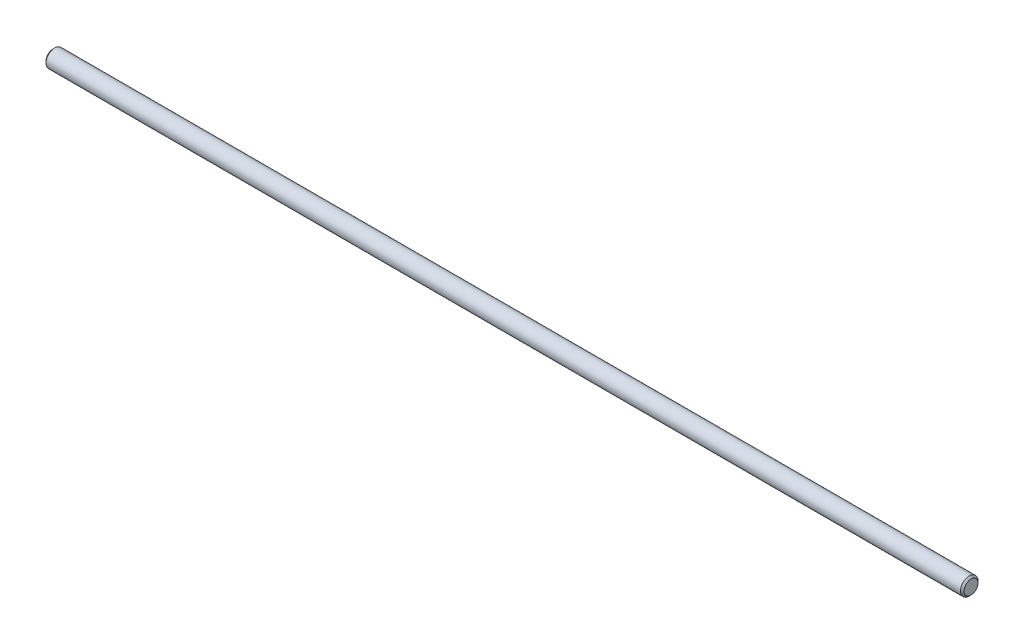
ISO-10303-21;
HEADER;
FILE_DESCRIPTION(('STEP AP214'),'2;1');
FILE_NAME('part.step','',(''),(''),'','','');
FILE_SCHEMA(('AUTOMOTIVE_DESIGN { 1 0 10303 214 1 1 1 1 }'));
ENDSEC;
DATA;
#1=APPLICATION_CONTEXT('core data for automotive mechanical design processes');
#2=APPLICATION_PROTOCOL_DEFINITION('international standard','automotive_design',2000,#1);
#3=PRODUCT_CONTEXT('',#1,'mechanical');
#4=PRODUCT('Part','Part','',(#3));
#5=PRODUCT_RELATED_PRODUCT_CATEGORY('part','',(#4));
#6=PRODUCT_DEFINITION_FORMATION('','',#4);
#7=PRODUCT_DEFINITION_CONTEXT('part definition',#1,'design');
#8=PRODUCT_DEFINITION('design','',#6,#7);
#9=PRODUCT_DEFINITION_SHAPE('','',#8);
#10=(LENGTH_UNIT() NAMED_UNIT(*) SI_UNIT(.MILLI.,.METRE.));
#11=(NAMED_UNIT(*) PLANE_ANGLE_UNIT() SI_UNIT($,.RADIAN.));
#12=(NAMED_UNIT(*) SI_UNIT($,.STERADIAN.) SOLID_ANGLE_UNIT());
#13=UNCERTAINTY_MEASURE_WITH_UNIT(LENGTH_MEASURE(1.E-05),#10,'distance_accuracy_value','');
#14=(GEOMETRIC_REPRESENTATION_CONTEXT(3) GLOBAL_UNCERTAINTY_ASSIGNED_CONTEXT((#13)) GLOBAL_UNIT_ASSIGNED_CONTEXT((#10,
#11,#12)) REPRESENTATION_CONTEXT('',''));
#15=CARTESIAN_POINT('',(0.,0.,0.));
#16=DIRECTION('',(0.,0.,1.));
#17=DIRECTION('',(1.,0.,0.));
#18=AXIS2_PLACEMENT_3D('',#15,#16,#17);
#19=CARTESIAN_POINT('',(210.,0.,0.));
#20=DIRECTION('',(-1.,0.,0.));
#21=DIRECTION('',(0.,0.,1.));
#22=AXIS2_PLACEMENT_3D('',#19,#20,#21);
#23=CYLINDRICAL_SURFACE('',#22,4.);
#24=CARTESIAN_POINT('',(-209.2,0.,0.));
#25=DIRECTION('',(1.,0.,0.));
#26=DIRECTION('',(0.,0.,-1.));
#27=AXIS2_PLACEMENT_3D('',#24,#25,#26);
#28=CIRCLE('',#27,4.);
#29=CARTESIAN_POINT('',(-209.2,0.,-4.));
#30=VERTEX_POINT('',#29);
#31=EDGE_CURVE('E46',#30,#30,#28,.T.);
#32=ORIENTED_EDGE('',*,*,#31,.T.);
#33=EDGE_LOOP('',(#32));
#34=FACE_BOUND('',#33,.T.);
#35=CARTESIAN_POINT('',(209.2,0.,0.));
#36=DIRECTION('',(1.,0.,0.));
#37=DIRECTION('',(0.,0.,-1.));
#38=AXIS2_PLACEMENT_3D('',#35,#36,#37);
#39=CIRCLE('',#38,4.);
#40=CARTESIAN_POINT('',(209.2,0.,-4.));
#41=VERTEX_POINT('',#40);
#42=EDGE_CURVE('E50',#41,#41,#39,.F.);
#43=ORIENTED_EDGE('',*,*,#42,.T.);
#44=EDGE_LOOP('',(#43));
#45=FACE_BOUND('',#44,.T.);
#46=ADVANCED_FACE('F35',(#34,#45),#23,.T.);
#47=CARTESIAN_POINT('',(210.,0.,0.));
#48=DIRECTION('',(1.,0.,0.));
#49=DIRECTION('',(0.,0.,-1.));
#50=AXIS2_PLACEMENT_3D('',#47,#48,#49);
#51=PLANE('',#50);
#52=CARTESIAN_POINT('',(210.,0.,0.));
#53=DIRECTION('',(1.,0.,0.));
#54=DIRECTION('',(0.,0.,-1.));
#55=AXIS2_PLACEMENT_3D('',#52,#53,#54);
#56=CIRCLE('',#55,3.20000000000009);
#57=CARTESIAN_POINT('',(210.,0.,-3.20000000000009));
#58=VERTEX_POINT('',#57);
#59=EDGE_CURVE('E10',#58,#58,#56,.T.);
#60=ORIENTED_EDGE('',*,*,#59,.T.);
#61=EDGE_LOOP('',(#60));
#62=FACE_BOUND('',#61,.T.);
#63=ADVANCED_FACE('F66',(#62),#51,.T.);
#64=CARTESIAN_POINT('',(-210.,0.,0.));
#65=DIRECTION('',(1.,0.,0.));
#66=DIRECTION('',(0.,0.,-1.));
#67=AXIS2_PLACEMENT_3D('',#64,#65,#66);
#68=PLANE('',#67);
#69=CARTESIAN_POINT('',(-210.,0.,0.));
#70=DIRECTION('',(1.,0.,0.));
#71=DIRECTION('',(0.,0.,-1.));
#72=AXIS2_PLACEMENT_3D('',#69,#70,#71);
#73=CIRCLE('',#72,3.19999999999998);
#74=CARTESIAN_POINT('',(-210.,0.,-3.19999999999998));
#75=VERTEX_POINT('',#74);
#76=EDGE_CURVE('E42',#75,#75,#73,.F.);
#77=ORIENTED_EDGE('',*,*,#76,.T.);
#78=EDGE_LOOP('',(#77));
#79=FACE_BOUND('',#78,.T.);
#80=ADVANCED_FACE('F63',(#79),#68,.F.);
#81=CARTESIAN_POINT('',(-209.2,0.,0.));
#82=DIRECTION('',(1.,0.,0.));
#83=DIRECTION('',(0.,0.,-1.));
#84=AXIS2_PLACEMENT_3D('',#81,#82,#83);
#85=CONICAL_SURFACE('',#84,4.,0.785398163397446);
#86=ORIENTED_EDGE('',*,*,#76,.F.);
#87=EDGE_LOOP('',(#86));
#88=FACE_BOUND('',#87,.T.);
#89=ORIENTED_EDGE('',*,*,#31,.F.);
#90=EDGE_LOOP('',(#89));
#91=FACE_BOUND('',#90,.T.);
#92=ADVANCED_FACE('F59',(#88,#91),#85,.T.);
#93=CARTESIAN_POINT('',(210.,0.,0.));
#94=DIRECTION('',(-1.,0.,0.));
#95=DIRECTION('',(0.,0.,1.));
#96=AXIS2_PLACEMENT_3D('',#93,#94,#95);
#97=CONICAL_SURFACE('',#96,3.20000000000009,0.785398163397446);
#98=ORIENTED_EDGE('',*,*,#42,.F.);
#99=EDGE_LOOP('',(#98));
#100=FACE_BOUND('',#99,.T.);
#101=ORIENTED_EDGE('',*,*,#59,.F.);
#102=EDGE_LOOP('',(#101));
#103=FACE_BOUND('',#102,.T.);
#104=ADVANCED_FACE('F37',(#100,#103),#97,.T.);
#105=CLOSED_SHELL('',(#46,#63,#80,#92,#104));
#106=MANIFOLD_SOLID_BREP('B2',#105);
#107=ADVANCED_BREP_SHAPE_REPRESENTATION('',(#18,#106),#14);
#108=SHAPE_DEFINITION_REPRESENTATION(#9,#107);
ENDSEC;
END-ISO-10303-21;
